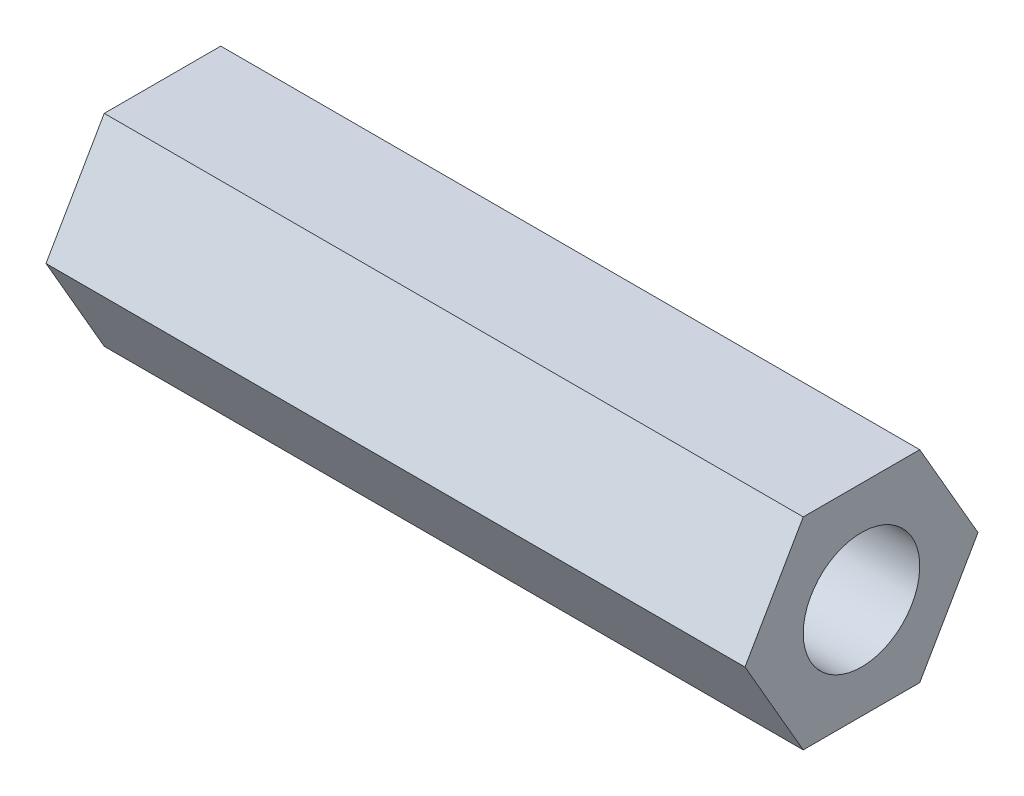
ISO-10303-21;
HEADER;
FILE_DESCRIPTION(('STEP AP214'),'2;1');
FILE_NAME('part.step','',(''),(''),'','','');
FILE_SCHEMA(('AUTOMOTIVE_DESIGN { 1 0 10303 214 1 1 1 1 }'));
ENDSEC;
DATA;
#1=APPLICATION_CONTEXT('core data for automotive mechanical design processes');
#2=APPLICATION_PROTOCOL_DEFINITION('international standard','automotive_design',2000,#1);
#3=PRODUCT_CONTEXT('',#1,'mechanical');
#4=PRODUCT('Part','Part','',(#3));
#5=PRODUCT_RELATED_PRODUCT_CATEGORY('part','',(#4));
#6=PRODUCT_DEFINITION_FORMATION('','',#4);
#7=PRODUCT_DEFINITION_CONTEXT('part definition',#1,'design');
#8=PRODUCT_DEFINITION('design','',#6,#7);
#9=PRODUCT_DEFINITION_SHAPE('','',#8);
#10=(LENGTH_UNIT() NAMED_UNIT(*) SI_UNIT(.MILLI.,.METRE.));
#11=(NAMED_UNIT(*) PLANE_ANGLE_UNIT() SI_UNIT($,.RADIAN.));
#12=(NAMED_UNIT(*) SI_UNIT($,.STERADIAN.) SOLID_ANGLE_UNIT());
#13=UNCERTAINTY_MEASURE_WITH_UNIT(LENGTH_MEASURE(1.E-05),#10,'distance_accuracy_value','');
#14=(GEOMETRIC_REPRESENTATION_CONTEXT(3) GLOBAL_UNCERTAINTY_ASSIGNED_CONTEXT((#13)) GLOBAL_UNIT_ASSIGNED_CONTEXT((#10,
#11,#12)) REPRESENTATION_CONTEXT('',''));
#15=CARTESIAN_POINT('',(0.,0.,0.));
#16=DIRECTION('',(0.,0.,1.));
#17=DIRECTION('',(1.,0.,0.));
#18=AXIS2_PLACEMENT_3D('',#15,#16,#17);
#19=CARTESIAN_POINT('',(38.1,-5.4992682460469,-3.17498799336631));
#20=DIRECTION('',(0.,0.500001890806071,0.866024312124292));
#21=DIRECTION('',(0.,-0.866024312124292,0.500001890806071));
#22=AXIS2_PLACEMENT_3D('',#19,#20,#21);
#23=PLANE('',#22);
#24=DIRECTION('',(0.,0.866024312124292,-0.500001890806071));
#25=VECTOR('',#24,1.);
#26=CARTESIAN_POINT('',(0.,-5.4992682460469,-3.17498799336631));
#27=LINE('',#26,#25);
#28=CARTESIAN_POINT('',(0.,-5.4992682460469,-3.17498799336631));
#29=VERTEX_POINT('',#28);
#30=CARTESIAN_POINT('',(0.,-1.38640576428382E-05,-6.34999999998486));
#31=VERTEX_POINT('',#30);
#32=EDGE_CURVE('E118',#29,#31,#27,.T.);
#33=ORIENTED_EDGE('',*,*,#32,.T.);
#34=DIRECTION('',(-1.,0.,0.));
#35=VECTOR('',#34,1.);
#36=CARTESIAN_POINT('',(38.1,-1.38640576428382E-05,-6.34999999998486));
#37=LINE('',#36,#35);
#38=CARTESIAN_POINT('',(38.1,-1.38640576428382E-05,-6.34999999998486));
#39=VERTEX_POINT('',#38);
#40=EDGE_CURVE('E11',#39,#31,#37,.T.);
#41=ORIENTED_EDGE('',*,*,#40,.F.);
#42=DIRECTION('',(0.,0.866024312124292,-0.500001890806071));
#43=VECTOR('',#42,1.);
#44=CARTESIAN_POINT('',(38.1,-5.4992682460469,-3.17498799336631));
#45=LINE('',#44,#43);
#46=CARTESIAN_POINT('',(38.1,-5.4992682460469,-3.17498799336631));
#47=VERTEX_POINT('',#46);
#48=EDGE_CURVE('E129',#47,#39,#45,.T.);
#49=ORIENTED_EDGE('',*,*,#48,.F.);
#50=DIRECTION('',(-1.,0.,0.));
#51=VECTOR('',#50,1.);
#52=CARTESIAN_POINT('',(38.1,-5.4992682460469,-3.17498799336631));
#53=LINE('',#52,#51);
#54=EDGE_CURVE('E114',#47,#29,#53,.T.);
#55=ORIENTED_EDGE('',*,*,#54,.T.);
#56=EDGE_LOOP('',(#33,#41,#49,#55));
#57=FACE_BOUND('',#56,.T.);
#58=ADVANCED_FACE('F34',(#57),#23,.F.);
#59=CARTESIAN_POINT('',(38.1,-1.38640576428382E-05,-6.34999999998486));
#60=DIRECTION('',(0.,-0.499998109191545,0.866026495440457));
#61=DIRECTION('',(0.,-0.866026495440457,-0.499998109191545));
#62=AXIS2_PLACEMENT_3D('',#59,#60,#61);
#63=PLANE('',#62);
#64=DIRECTION('',(0.,0.866026495440457,0.499998109191545));
#65=VECTOR('',#64,1.);
#66=CARTESIAN_POINT('',(0.,-1.38640576428382E-05,-6.34999999998486));
#67=LINE('',#66,#65);
#68=CARTESIAN_POINT('',(0.,5.49925438198926,-3.17501200661855));
#69=VERTEX_POINT('',#68);
#70=EDGE_CURVE('E121',#31,#69,#67,.T.);
#71=ORIENTED_EDGE('',*,*,#70,.T.);
#72=DIRECTION('',(-1.,0.,0.));
#73=VECTOR('',#72,1.);
#74=CARTESIAN_POINT('',(38.1,5.49925438198926,-3.17501200661855));
#75=LINE('',#74,#73);
#76=CARTESIAN_POINT('',(38.1,5.49925438198926,-3.17501200661855));
#77=VERTEX_POINT('',#76);
#78=EDGE_CURVE('E42',#77,#69,#75,.T.);
#79=ORIENTED_EDGE('',*,*,#78,.F.);
#80=DIRECTION('',(0.,0.866026495440457,0.499998109191545));
#81=VECTOR('',#80,1.);
#82=CARTESIAN_POINT('',(38.1,-1.38640576428382E-05,-6.34999999998486));
#83=LINE('',#82,#81);
#84=EDGE_CURVE('E87',#39,#77,#83,.T.);
#85=ORIENTED_EDGE('',*,*,#84,.F.);
#86=ORIENTED_EDGE('',*,*,#40,.T.);
#87=EDGE_LOOP('',(#71,#79,#85,#86));
#88=FACE_BOUND('',#87,.T.);
#89=ADVANCED_FACE('F154',(#88),#63,.F.);
#90=CARTESIAN_POINT('',(38.1,5.49925438198926,-3.17501200661855));
#91=DIRECTION('',(0.,-0.999999999997617,2.18331616456291E-06));
#92=DIRECTION('',(0.,-2.18331616456291E-06,-0.999999999997617));
#93=AXIS2_PLACEMENT_3D('',#90,#91,#92);
#94=PLANE('',#93);
#95=DIRECTION('',(0.,2.18331616456291E-06,0.999999999997617));
#96=VECTOR('',#95,1.);
#97=CARTESIAN_POINT('',(0.,5.49925438198926,-3.17501200661855));
#98=LINE('',#97,#96);
#99=CARTESIAN_POINT('',(0.,5.4992682460469,3.17498799336631));
#100=VERTEX_POINT('',#99);
#101=EDGE_CURVE('E124',#69,#100,#98,.T.);
#102=ORIENTED_EDGE('',*,*,#101,.T.);
#103=DIRECTION('',(-1.,0.,0.));
#104=VECTOR('',#103,1.);
#105=CARTESIAN_POINT('',(38.1,5.4992682460469,3.17498799336631));
#106=LINE('',#105,#104);
#107=CARTESIAN_POINT('',(38.1,5.4992682460469,3.17498799336631));
#108=VERTEX_POINT('',#107);
#109=EDGE_CURVE('E109',#108,#100,#106,.T.);
#110=ORIENTED_EDGE('',*,*,#109,.F.);
#111=DIRECTION('',(0.,2.18331616456291E-06,0.999999999997617));
#112=VECTOR('',#111,1.);
#113=CARTESIAN_POINT('',(38.1,5.49925438198926,-3.17501200661855));
#114=LINE('',#113,#112);
#115=EDGE_CURVE('E100',#77,#108,#114,.T.);
#116=ORIENTED_EDGE('',*,*,#115,.F.);
#117=ORIENTED_EDGE('',*,*,#78,.T.);
#118=EDGE_LOOP('',(#102,#110,#116,#117));
#119=FACE_BOUND('',#118,.T.);
#120=ADVANCED_FACE('F135',(#119),#94,.F.);
#121=CARTESIAN_POINT('',(38.1,5.4992682460469,3.17498799336631));
#122=DIRECTION('',(0.,-0.500001890806071,-0.866024312124292));
#123=DIRECTION('',(0.,0.866024312124292,-0.500001890806071));
#124=AXIS2_PLACEMENT_3D('',#121,#122,#123);
#125=PLANE('',#124);
#126=DIRECTION('',(0.,-0.866024312124292,0.500001890806071));
#127=VECTOR('',#126,1.);
#128=CARTESIAN_POINT('',(0.,5.4992682460469,3.17498799336631));
#129=LINE('',#128,#127);
#130=CARTESIAN_POINT('',(0.,1.38640576455113E-05,6.34999999998487));
#131=VERTEX_POINT('',#130);
#132=EDGE_CURVE('E108',#100,#131,#129,.T.);
#133=ORIENTED_EDGE('',*,*,#132,.T.);
#134=DIRECTION('',(-1.,0.,0.));
#135=VECTOR('',#134,1.);
#136=CARTESIAN_POINT('',(38.1,1.38640576455113E-05,6.34999999998487));
#137=LINE('',#136,#135);
#138=CARTESIAN_POINT('',(38.1,1.38640576455113E-05,6.34999999998487));
#139=VERTEX_POINT('',#138);
#140=EDGE_CURVE('E105',#139,#131,#137,.T.);
#141=ORIENTED_EDGE('',*,*,#140,.F.);
#142=DIRECTION('',(0.,-0.866024312124292,0.500001890806071));
#143=VECTOR('',#142,1.);
#144=CARTESIAN_POINT('',(38.1,5.4992682460469,3.17498799336631));
#145=LINE('',#144,#143);
#146=EDGE_CURVE('E94',#108,#139,#145,.T.);
#147=ORIENTED_EDGE('',*,*,#146,.F.);
#148=ORIENTED_EDGE('',*,*,#109,.T.);
#149=EDGE_LOOP('',(#133,#141,#147,#148));
#150=FACE_BOUND('',#149,.T.);
#151=ADVANCED_FACE('F106',(#150),#125,.F.);
#152=CARTESIAN_POINT('',(38.1,1.38640576455113E-05,6.34999999998487));
#153=DIRECTION('',(0.,0.499998109191545,-0.866026495440457));
#154=DIRECTION('',(0.,0.866026495440457,0.499998109191545));
#155=AXIS2_PLACEMENT_3D('',#152,#153,#154);
#156=PLANE('',#155);
#157=DIRECTION('',(0.,-0.866026495440457,-0.499998109191545));
#158=VECTOR('',#157,1.);
#159=CARTESIAN_POINT('',(0.,1.38640576455113E-05,6.34999999998487));
#160=LINE('',#159,#158);
#161=CARTESIAN_POINT('',(0.,-5.49925438198926,3.17501200661855));
#162=VERTEX_POINT('',#161);
#163=EDGE_CURVE('E73',#131,#162,#160,.T.);
#164=ORIENTED_EDGE('',*,*,#163,.T.);
#165=DIRECTION('',(-1.,0.,0.));
#166=VECTOR('',#165,1.);
#167=CARTESIAN_POINT('',(38.1,-5.49925438198926,3.17501200661855));
#168=LINE('',#167,#166);
#169=CARTESIAN_POINT('',(38.1,-5.49925438198926,3.17501200661855));
#170=VERTEX_POINT('',#169);
#171=EDGE_CURVE('E110',#170,#162,#168,.T.);
#172=ORIENTED_EDGE('',*,*,#171,.F.);
#173=DIRECTION('',(0.,-0.866026495440457,-0.499998109191545));
#174=VECTOR('',#173,1.);
#175=CARTESIAN_POINT('',(38.1,1.38640576455113E-05,6.34999999998487));
#176=LINE('',#175,#174);
#177=EDGE_CURVE('E98',#139,#170,#176,.T.);
#178=ORIENTED_EDGE('',*,*,#177,.F.);
#179=ORIENTED_EDGE('',*,*,#140,.T.);
#180=EDGE_LOOP('',(#164,#172,#178,#179));
#181=FACE_BOUND('',#180,.T.);
#182=ADVANCED_FACE('F112',(#181),#156,.F.);
#183=CARTESIAN_POINT('',(38.1,-5.49925438198926,3.17501200661855));
#184=DIRECTION('',(0.,0.999999999997617,-2.18331616483609E-06));
#185=DIRECTION('',(0.,2.18331616483609E-06,0.999999999997617));
#186=AXIS2_PLACEMENT_3D('',#183,#184,#185);
#187=PLANE('',#186);
#188=DIRECTION('',(0.,-2.18331616483609E-06,-0.999999999997617));
#189=VECTOR('',#188,1.);
#190=CARTESIAN_POINT('',(0.,-5.49925438198926,3.17501200661855));
#191=LINE('',#190,#189);
#192=EDGE_CURVE('E79',#162,#29,#191,.T.);
#193=ORIENTED_EDGE('',*,*,#192,.T.);
#194=ORIENTED_EDGE('',*,*,#54,.F.);
#195=DIRECTION('',(0.,-2.18331616483609E-06,-0.999999999997617));
#196=VECTOR('',#195,1.);
#197=CARTESIAN_POINT('',(38.1,-5.49925438198926,3.17501200661855));
#198=LINE('',#197,#196);
#199=EDGE_CURVE('E50',#170,#47,#198,.T.);
#200=ORIENTED_EDGE('',*,*,#199,.F.);
#201=ORIENTED_EDGE('',*,*,#171,.T.);
#202=EDGE_LOOP('',(#193,#194,#200,#201));
#203=FACE_BOUND('',#202,.T.);
#204=ADVANCED_FACE('F142',(#203),#187,.F.);
#205=CARTESIAN_POINT('',(38.1,0.,0.));
#206=DIRECTION('',(1.,0.,0.));
#207=DIRECTION('',(0.,0.,-1.));
#208=AXIS2_PLACEMENT_3D('',#205,#206,#207);
#209=PLANE('',#208);
#210=CARTESIAN_POINT('',(38.1,0.,0.));
#211=DIRECTION('',(-1.,0.,0.));
#212=DIRECTION('',(0.,0.,1.));
#213=AXIS2_PLACEMENT_3D('',#210,#211,#212);
#214=CIRCLE('',#213,3.175);
#215=CARTESIAN_POINT('',(38.1,0.,3.175));
#216=VERTEX_POINT('',#215);
#217=EDGE_CURVE('E122',#216,#216,#214,.T.);
#218=ORIENTED_EDGE('',*,*,#217,.T.);
#219=EDGE_LOOP('',(#218));
#220=FACE_BOUND('',#219,.T.);
#221=ORIENTED_EDGE('',*,*,#48,.T.);
#222=ORIENTED_EDGE('',*,*,#84,.T.);
#223=ORIENTED_EDGE('',*,*,#115,.T.);
#224=ORIENTED_EDGE('',*,*,#146,.T.);
#225=ORIENTED_EDGE('',*,*,#177,.T.);
#226=ORIENTED_EDGE('',*,*,#199,.T.);
#227=EDGE_LOOP('',(#221,#222,#223,#224,#225,#226));
#228=FACE_BOUND('',#227,.T.);
#229=ADVANCED_FACE('F96',(#220,#228),#209,.T.);
#230=CARTESIAN_POINT('',(0.,0.,0.));
#231=DIRECTION('',(1.,0.,0.));
#232=DIRECTION('',(0.,0.,-1.));
#233=AXIS2_PLACEMENT_3D('',#230,#231,#232);
#234=PLANE('',#233);
#235=CARTESIAN_POINT('',(0.,0.,0.));
#236=DIRECTION('',(-1.,0.,0.));
#237=DIRECTION('',(0.,0.,1.));
#238=AXIS2_PLACEMENT_3D('',#235,#236,#237);
#239=CIRCLE('',#238,3.175);
#240=CARTESIAN_POINT('',(0.,0.,3.175));
#241=VERTEX_POINT('',#240);
#242=EDGE_CURVE('E209',#241,#241,#239,.T.);
#243=ORIENTED_EDGE('',*,*,#242,.F.);
#244=EDGE_LOOP('',(#243));
#245=FACE_BOUND('',#244,.T.);
#246=ORIENTED_EDGE('',*,*,#32,.F.);
#247=ORIENTED_EDGE('',*,*,#192,.F.);
#248=ORIENTED_EDGE('',*,*,#163,.F.);
#249=ORIENTED_EDGE('',*,*,#132,.F.);
#250=ORIENTED_EDGE('',*,*,#101,.F.);
#251=ORIENTED_EDGE('',*,*,#70,.F.);
#252=EDGE_LOOP('',(#246,#247,#248,#249,#250,#251));
#253=FACE_BOUND('',#252,.T.);
#254=ADVANCED_FACE('F138',(#245,#253),#234,.F.);
#255=CARTESIAN_POINT('',(38.1,0.,0.));
#256=DIRECTION('',(-1.,0.,0.));
#257=DIRECTION('',(0.,0.,1.));
#258=AXIS2_PLACEMENT_3D('',#255,#256,#257);
#259=CYLINDRICAL_SURFACE('',#258,3.175);
#260=ORIENTED_EDGE('',*,*,#217,.F.);
#261=EDGE_LOOP('',(#260));
#262=FACE_BOUND('',#261,.T.);
#263=ORIENTED_EDGE('',*,*,#242,.T.);
#264=EDGE_LOOP('',(#263));
#265=FACE_BOUND('',#264,.T.);
#266=ADVANCED_FACE('F191',(#262,#265),#259,.F.);
#267=CLOSED_SHELL('',(#58,#89,#120,#151,#182,#204,#229,#254,#266));
#268=MANIFOLD_SOLID_BREP('B2',#267);
#269=ADVANCED_BREP_SHAPE_REPRESENTATION('',(#18,#268),#14);
#270=SHAPE_DEFINITION_REPRESENTATION(#9,#269);
ENDSEC;
END-ISO-10303-21;
